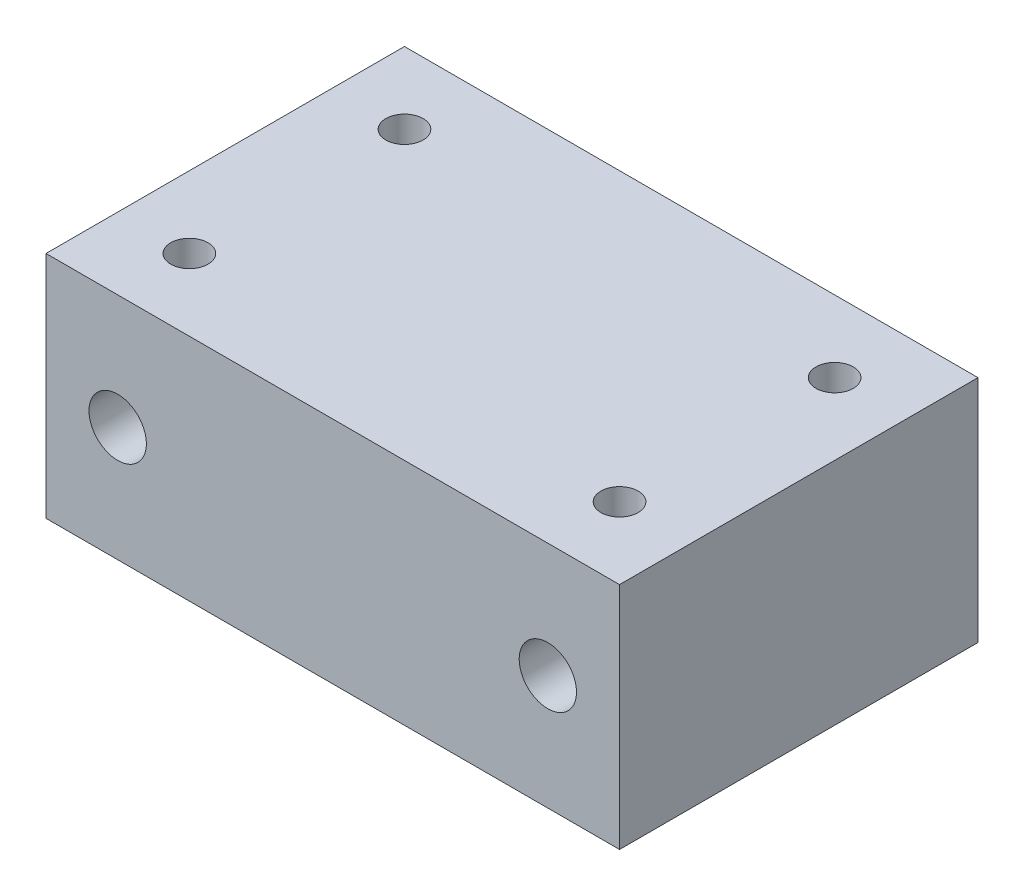
ISO-10303-21;
HEADER;
FILE_DESCRIPTION(('STEP AP214'),'2;1');
FILE_NAME('part.step','',(''),(''),'','','');
FILE_SCHEMA(('AUTOMOTIVE_DESIGN { 1 0 10303 214 1 1 1 1 }'));
ENDSEC;
DATA;
#1=APPLICATION_CONTEXT('core data for automotive mechanical design processes');
#2=APPLICATION_PROTOCOL_DEFINITION('international standard','automotive_design',2000,#1);
#3=PRODUCT_CONTEXT('',#1,'mechanical');
#4=PRODUCT('Part','Part','',(#3));
#5=PRODUCT_RELATED_PRODUCT_CATEGORY('part','',(#4));
#6=PRODUCT_DEFINITION_FORMATION('','',#4);
#7=PRODUCT_DEFINITION_CONTEXT('part definition',#1,'design');
#8=PRODUCT_DEFINITION('design','',#6,#7);
#9=PRODUCT_DEFINITION_SHAPE('','',#8);
#10=(LENGTH_UNIT() NAMED_UNIT(*) SI_UNIT(.MILLI.,.METRE.));
#11=(NAMED_UNIT(*) PLANE_ANGLE_UNIT() SI_UNIT($,.RADIAN.));
#12=(NAMED_UNIT(*) SI_UNIT($,.STERADIAN.) SOLID_ANGLE_UNIT());
#13=UNCERTAINTY_MEASURE_WITH_UNIT(LENGTH_MEASURE(1.E-05),#10,'distance_accuracy_value','');
#14=(GEOMETRIC_REPRESENTATION_CONTEXT(3) GLOBAL_UNCERTAINTY_ASSIGNED_CONTEXT((#13)) GLOBAL_UNIT_ASSIGNED_CONTEXT((#10,
#11,#12)) REPRESENTATION_CONTEXT('',''));
#15=CARTESIAN_POINT('',(0.,0.,0.));
#16=DIRECTION('',(0.,0.,1.));
#17=DIRECTION('',(1.,0.,0.));
#18=AXIS2_PLACEMENT_3D('',#15,#16,#17);
#19=CARTESIAN_POINT('',(40.,32.,-25.));
#20=DIRECTION('',(-1.,0.,0.));
#21=DIRECTION('',(0.,0.,1.));
#22=AXIS2_PLACEMENT_3D('',#19,#20,#21);
#23=PLANE('',#22);
#24=DIRECTION('',(0.,0.,-1.));
#25=VECTOR('',#24,1.);
#26=CARTESIAN_POINT('',(40.,0.,-25.));
#27=LINE('',#26,#25);
#28=CARTESIAN_POINT('',(40.,0.,25.));
#29=VERTEX_POINT('',#28);
#30=CARTESIAN_POINT('',(40.,0.,-25.));
#31=VERTEX_POINT('',#30);
#32=EDGE_CURVE('E98',#29,#31,#27,.T.);
#33=ORIENTED_EDGE('',*,*,#32,.T.);
#34=DIRECTION('',(0.,-1.,0.));
#35=VECTOR('',#34,1.);
#36=CARTESIAN_POINT('',(40.,32.,-25.));
#37=LINE('',#36,#35);
#38=CARTESIAN_POINT('',(40.,32.,-25.));
#39=VERTEX_POINT('',#38);
#40=EDGE_CURVE('E11',#39,#31,#37,.T.);
#41=ORIENTED_EDGE('',*,*,#40,.F.);
#42=DIRECTION('',(0.,0.,-1.));
#43=VECTOR('',#42,1.);
#44=CARTESIAN_POINT('',(40.,32.,-25.));
#45=LINE('',#44,#43);
#46=CARTESIAN_POINT('',(40.,32.,25.));
#47=VERTEX_POINT('',#46);
#48=EDGE_CURVE('E85',#47,#39,#45,.T.);
#49=ORIENTED_EDGE('',*,*,#48,.F.);
#50=DIRECTION('',(0.,-1.,0.));
#51=VECTOR('',#50,1.);
#52=CARTESIAN_POINT('',(40.,32.,25.));
#53=LINE('',#52,#51);
#54=EDGE_CURVE('E94',#47,#29,#53,.T.);
#55=ORIENTED_EDGE('',*,*,#54,.T.);
#56=EDGE_LOOP('',(#33,#41,#49,#55));
#57=FACE_BOUND('',#56,.T.);
#58=ADVANCED_FACE('F32',(#57),#23,.F.);
#59=CARTESIAN_POINT('',(-40.,32.,-25.));
#60=DIRECTION('',(0.,0.,1.));
#61=DIRECTION('',(1.,0.,0.));
#62=AXIS2_PLACEMENT_3D('',#59,#60,#61);
#63=PLANE('',#62);
#64=CARTESIAN_POINT('',(-30.,16.,-25.));
#65=DIRECTION('',(0.,0.,-1.));
#66=DIRECTION('',(-1.,0.,0.));
#67=AXIS2_PLACEMENT_3D('',#64,#65,#66);
#68=CIRCLE('',#67,4.);
#69=CARTESIAN_POINT('',(-34.,16.,-25.));
#70=VERTEX_POINT('',#69);
#71=EDGE_CURVE('E120',#70,#70,#68,.T.);
#72=ORIENTED_EDGE('',*,*,#71,.F.);
#73=EDGE_LOOP('',(#72));
#74=FACE_BOUND('',#73,.T.);
#75=CARTESIAN_POINT('',(30.,16.,-25.));
#76=DIRECTION('',(0.,0.,-1.));
#77=DIRECTION('',(-1.,0.,0.));
#78=AXIS2_PLACEMENT_3D('',#75,#76,#77);
#79=CIRCLE('',#78,4.);
#80=CARTESIAN_POINT('',(26.,16.,-25.));
#81=VERTEX_POINT('',#80);
#82=EDGE_CURVE('E109',#81,#81,#79,.T.);
#83=ORIENTED_EDGE('',*,*,#82,.F.);
#84=EDGE_LOOP('',(#83));
#85=FACE_BOUND('',#84,.T.);
#86=DIRECTION('',(-1.,0.,0.));
#87=VECTOR('',#86,1.);
#88=CARTESIAN_POINT('',(-40.,0.,-25.));
#89=LINE('',#88,#87);
#90=CARTESIAN_POINT('',(-40.,0.,-25.));
#91=VERTEX_POINT('',#90);
#92=EDGE_CURVE('E89',#31,#91,#89,.T.);
#93=ORIENTED_EDGE('',*,*,#92,.T.);
#94=DIRECTION('',(0.,-1.,0.));
#95=VECTOR('',#94,1.);
#96=CARTESIAN_POINT('',(-40.,32.,-25.));
#97=LINE('',#96,#95);
#98=CARTESIAN_POINT('',(-40.,32.,-25.));
#99=VERTEX_POINT('',#98);
#100=EDGE_CURVE('E41',#99,#91,#97,.T.);
#101=ORIENTED_EDGE('',*,*,#100,.F.);
#102=DIRECTION('',(-1.,0.,0.));
#103=VECTOR('',#102,1.);
#104=CARTESIAN_POINT('',(-40.,32.,-25.));
#105=LINE('',#104,#103);
#106=EDGE_CURVE('E80',#39,#99,#105,.T.);
#107=ORIENTED_EDGE('',*,*,#106,.F.);
#108=ORIENTED_EDGE('',*,*,#40,.T.);
#109=EDGE_LOOP('',(#93,#101,#107,#108));
#110=FACE_BOUND('',#109,.T.);
#111=ADVANCED_FACE('F88',(#74,#85,#110),#63,.F.);
#112=CARTESIAN_POINT('',(-40.,32.,-25.));
#113=DIRECTION('',(1.,0.,0.));
#114=DIRECTION('',(0.,0.,-1.));
#115=AXIS2_PLACEMENT_3D('',#112,#113,#114);
#116=PLANE('',#115);
#117=DIRECTION('',(0.,0.,1.));
#118=VECTOR('',#117,1.);
#119=CARTESIAN_POINT('',(-40.,0.,-25.));
#120=LINE('',#119,#118);
#121=CARTESIAN_POINT('',(-40.,0.,25.));
#122=VERTEX_POINT('',#121);
#123=EDGE_CURVE('E67',#91,#122,#120,.T.);
#124=ORIENTED_EDGE('',*,*,#123,.T.);
#125=DIRECTION('',(0.,-1.,0.));
#126=VECTOR('',#125,1.);
#127=CARTESIAN_POINT('',(-40.,32.,25.));
#128=LINE('',#127,#126);
#129=CARTESIAN_POINT('',(-40.,32.,25.));
#130=VERTEX_POINT('',#129);
#131=EDGE_CURVE('E90',#130,#122,#128,.T.);
#132=ORIENTED_EDGE('',*,*,#131,.F.);
#133=DIRECTION('',(0.,0.,1.));
#134=VECTOR('',#133,1.);
#135=CARTESIAN_POINT('',(-40.,32.,-25.));
#136=LINE('',#135,#134);
#137=EDGE_CURVE('E83',#99,#130,#136,.T.);
#138=ORIENTED_EDGE('',*,*,#137,.F.);
#139=ORIENTED_EDGE('',*,*,#100,.T.);
#140=EDGE_LOOP('',(#124,#132,#138,#139));
#141=FACE_BOUND('',#140,.T.);
#142=ADVANCED_FACE('F92',(#141),#116,.F.);
#143=CARTESIAN_POINT('',(-40.,32.,25.));
#144=DIRECTION('',(0.,0.,-1.));
#145=DIRECTION('',(-1.,0.,0.));
#146=AXIS2_PLACEMENT_3D('',#143,#144,#145);
#147=PLANE('',#146);
#148=CARTESIAN_POINT('',(-30.,16.,25.));
#149=DIRECTION('',(0.,0.,-1.));
#150=DIRECTION('',(-1.,0.,0.));
#151=AXIS2_PLACEMENT_3D('',#148,#149,#150);
#152=CIRCLE('',#151,4.);
#153=CARTESIAN_POINT('',(-34.,16.,25.));
#154=VERTEX_POINT('',#153);
#155=EDGE_CURVE('E35',#154,#154,#152,.T.);
#156=ORIENTED_EDGE('',*,*,#155,.T.);
#157=EDGE_LOOP('',(#156));
#158=FACE_BOUND('',#157,.T.);
#159=CARTESIAN_POINT('',(30.,16.,25.));
#160=DIRECTION('',(0.,0.,-1.));
#161=DIRECTION('',(-1.,0.,0.));
#162=AXIS2_PLACEMENT_3D('',#159,#160,#161);
#163=CIRCLE('',#162,4.);
#164=CARTESIAN_POINT('',(26.,16.,25.));
#165=VERTEX_POINT('',#164);
#166=EDGE_CURVE('E106',#165,#165,#163,.T.);
#167=ORIENTED_EDGE('',*,*,#166,.T.);
#168=EDGE_LOOP('',(#167));
#169=FACE_BOUND('',#168,.T.);
#170=DIRECTION('',(1.,0.,0.));
#171=VECTOR('',#170,1.);
#172=CARTESIAN_POINT('',(-40.,0.,25.));
#173=LINE('',#172,#171);
#174=EDGE_CURVE('E73',#122,#29,#173,.T.);
#175=ORIENTED_EDGE('',*,*,#174,.T.);
#176=ORIENTED_EDGE('',*,*,#54,.F.);
#177=DIRECTION('',(1.,0.,0.));
#178=VECTOR('',#177,1.);
#179=CARTESIAN_POINT('',(-40.,32.,25.));
#180=LINE('',#179,#178);
#181=EDGE_CURVE('E50',#130,#47,#180,.T.);
#182=ORIENTED_EDGE('',*,*,#181,.F.);
#183=ORIENTED_EDGE('',*,*,#131,.T.);
#184=EDGE_LOOP('',(#175,#176,#182,#183));
#185=FACE_BOUND('',#184,.T.);
#186=ADVANCED_FACE('F147',(#158,#169,#185),#147,.F.);
#187=CARTESIAN_POINT('',(0.,32.,0.));
#188=DIRECTION('',(0.,1.,0.));
#189=DIRECTION('',(0.,0.,1.));
#190=AXIS2_PLACEMENT_3D('',#187,#188,#189);
#191=PLANE('',#190);
#192=CARTESIAN_POINT('',(30.,32.,-15.));
#193=DIRECTION('',(0.,1.,0.));
#194=DIRECTION('',(0.,0.,-1.));
#195=AXIS2_PLACEMENT_3D('',#192,#193,#194);
#196=CIRCLE('',#195,2.6);
#197=CARTESIAN_POINT('',(30.,32.,-17.6));
#198=VERTEX_POINT('',#197);
#199=EDGE_CURVE('E127',#198,#198,#196,.T.);
#200=ORIENTED_EDGE('',*,*,#199,.F.);
#201=EDGE_LOOP('',(#200));
#202=FACE_BOUND('',#201,.T.);
#203=CARTESIAN_POINT('',(30.,32.,15.));
#204=DIRECTION('',(0.,1.,0.));
#205=DIRECTION('',(0.,0.,1.));
#206=AXIS2_PLACEMENT_3D('',#203,#204,#205);
#207=CIRCLE('',#206,2.6);
#208=CARTESIAN_POINT('',(30.,32.,17.6));
#209=VERTEX_POINT('',#208);
#210=EDGE_CURVE('E133',#209,#209,#207,.T.);
#211=ORIENTED_EDGE('',*,*,#210,.F.);
#212=EDGE_LOOP('',(#211));
#213=FACE_BOUND('',#212,.T.);
#214=CARTESIAN_POINT('',(-30.,32.,15.));
#215=DIRECTION('',(0.,1.,0.));
#216=DIRECTION('',(0.,0.,-1.));
#217=AXIS2_PLACEMENT_3D('',#214,#215,#216);
#218=CIRCLE('',#217,2.6);
#219=CARTESIAN_POINT('',(-30.,32.,12.4));
#220=VERTEX_POINT('',#219);
#221=EDGE_CURVE('E108',#220,#220,#218,.T.);
#222=ORIENTED_EDGE('',*,*,#221,.F.);
#223=EDGE_LOOP('',(#222));
#224=FACE_BOUND('',#223,.T.);
#225=CARTESIAN_POINT('',(-30.,32.,-15.));
#226=DIRECTION('',(0.,1.,0.));
#227=DIRECTION('',(0.,0.,1.));
#228=AXIS2_PLACEMENT_3D('',#225,#226,#227);
#229=CIRCLE('',#228,2.6);
#230=CARTESIAN_POINT('',(-30.,32.,-12.4));
#231=VERTEX_POINT('',#230);
#232=EDGE_CURVE('E126',#231,#231,#229,.T.);
#233=ORIENTED_EDGE('',*,*,#232,.F.);
#234=EDGE_LOOP('',(#233));
#235=FACE_BOUND('',#234,.T.);
#236=ORIENTED_EDGE('',*,*,#48,.T.);
#237=ORIENTED_EDGE('',*,*,#106,.T.);
#238=ORIENTED_EDGE('',*,*,#137,.T.);
#239=ORIENTED_EDGE('',*,*,#181,.T.);
#240=EDGE_LOOP('',(#236,#237,#238,#239));
#241=FACE_BOUND('',#240,.T.);
#242=ADVANCED_FACE('F81',(#202,#213,#224,#235,#241),#191,.T.);
#243=CARTESIAN_POINT('',(0.,0.,0.));
#244=DIRECTION('',(0.,1.,0.));
#245=DIRECTION('',(0.,0.,1.));
#246=AXIS2_PLACEMENT_3D('',#243,#244,#245);
#247=PLANE('',#246);
#248=ORIENTED_EDGE('',*,*,#32,.F.);
#249=ORIENTED_EDGE('',*,*,#174,.F.);
#250=ORIENTED_EDGE('',*,*,#123,.F.);
#251=ORIENTED_EDGE('',*,*,#92,.F.);
#252=EDGE_LOOP('',(#248,#249,#250,#251));
#253=FACE_BOUND('',#252,.T.);
#254=ADVANCED_FACE('F146',(#253),#247,.F.);
#255=CARTESIAN_POINT('',(-30.,27.,-15.));
#256=DIRECTION('',(0.,1.,0.));
#257=DIRECTION('',(0.,0.,1.));
#258=AXIS2_PLACEMENT_3D('',#255,#256,#257);
#259=CYLINDRICAL_SURFACE('',#258,2.6);
#260=CARTESIAN_POINT('',(-30.,27.,-15.));
#261=DIRECTION('',(0.,1.,0.));
#262=DIRECTION('',(0.,0.,1.));
#263=AXIS2_PLACEMENT_3D('',#260,#261,#262);
#264=CIRCLE('',#263,2.6);
#265=CARTESIAN_POINT('',(-30.,27.,-12.4));
#266=VERTEX_POINT('',#265);
#267=EDGE_CURVE('E101',#266,#266,#264,.T.);
#268=ORIENTED_EDGE('',*,*,#267,.F.);
#269=EDGE_LOOP('',(#268));
#270=FACE_BOUND('',#269,.T.);
#271=ORIENTED_EDGE('',*,*,#232,.T.);
#272=EDGE_LOOP('',(#271));
#273=FACE_BOUND('',#272,.T.);
#274=ADVANCED_FACE('F143',(#270,#273),#259,.F.);
#275=CARTESIAN_POINT('',(-30.,27.,-15.));
#276=DIRECTION('',(0.,1.,0.));
#277=DIRECTION('',(0.,0.,1.));
#278=AXIS2_PLACEMENT_3D('',#275,#276,#277);
#279=PLANE('',#278);
#280=ORIENTED_EDGE('',*,*,#267,.T.);
#281=EDGE_LOOP('',(#280));
#282=FACE_BOUND('',#281,.T.);
#283=ADVANCED_FACE('F210',(#282),#279,.T.);
#284=CARTESIAN_POINT('',(-30.,27.,15.));
#285=DIRECTION('',(0.,1.,0.));
#286=DIRECTION('',(0.,0.,1.));
#287=AXIS2_PLACEMENT_3D('',#284,#285,#286);
#288=CYLINDRICAL_SURFACE('',#287,2.6);
#289=CARTESIAN_POINT('',(-30.,27.,15.));
#290=DIRECTION('',(0.,1.,0.));
#291=DIRECTION('',(0.,0.,-1.));
#292=AXIS2_PLACEMENT_3D('',#289,#290,#291);
#293=CIRCLE('',#292,2.6);
#294=CARTESIAN_POINT('',(-30.,27.,12.4));
#295=VERTEX_POINT('',#294);
#296=EDGE_CURVE('E113',#295,#295,#293,.T.);
#297=ORIENTED_EDGE('',*,*,#296,.F.);
#298=EDGE_LOOP('',(#297));
#299=FACE_BOUND('',#298,.T.);
#300=ORIENTED_EDGE('',*,*,#221,.T.);
#301=EDGE_LOOP('',(#300));
#302=FACE_BOUND('',#301,.T.);
#303=ADVANCED_FACE('F206',(#299,#302),#288,.F.);
#304=CARTESIAN_POINT('',(-30.,27.,15.));
#305=DIRECTION('',(0.,-1.,0.));
#306=DIRECTION('',(0.,0.,-1.));
#307=AXIS2_PLACEMENT_3D('',#304,#305,#306);
#308=PLANE('',#307);
#309=ORIENTED_EDGE('',*,*,#296,.T.);
#310=EDGE_LOOP('',(#309));
#311=FACE_BOUND('',#310,.T.);
#312=ADVANCED_FACE('F202',(#311),#308,.F.);
#313=CARTESIAN_POINT('',(30.,27.,15.));
#314=DIRECTION('',(0.,1.,0.));
#315=DIRECTION('',(0.,0.,1.));
#316=AXIS2_PLACEMENT_3D('',#313,#314,#315);
#317=CYLINDRICAL_SURFACE('',#316,2.6);
#318=CARTESIAN_POINT('',(30.,27.,15.));
#319=DIRECTION('',(0.,1.,0.));
#320=DIRECTION('',(0.,0.,1.));
#321=AXIS2_PLACEMENT_3D('',#318,#319,#320);
#322=CIRCLE('',#321,2.6);
#323=CARTESIAN_POINT('',(30.,27.,17.6));
#324=VERTEX_POINT('',#323);
#325=EDGE_CURVE('E130',#324,#324,#322,.T.);
#326=ORIENTED_EDGE('',*,*,#325,.F.);
#327=EDGE_LOOP('',(#326));
#328=FACE_BOUND('',#327,.T.);
#329=ORIENTED_EDGE('',*,*,#210,.T.);
#330=EDGE_LOOP('',(#329));
#331=FACE_BOUND('',#330,.T.);
#332=ADVANCED_FACE('F198',(#328,#331),#317,.F.);
#333=CARTESIAN_POINT('',(30.,27.,15.));
#334=DIRECTION('',(0.,1.,0.));
#335=DIRECTION('',(0.,0.,1.));
#336=AXIS2_PLACEMENT_3D('',#333,#334,#335);
#337=PLANE('',#336);
#338=ORIENTED_EDGE('',*,*,#325,.T.);
#339=EDGE_LOOP('',(#338));
#340=FACE_BOUND('',#339,.T.);
#341=ADVANCED_FACE('F194',(#340),#337,.T.);
#342=CARTESIAN_POINT('',(30.,27.,-15.));
#343=DIRECTION('',(0.,1.,0.));
#344=DIRECTION('',(0.,0.,1.));
#345=AXIS2_PLACEMENT_3D('',#342,#343,#344);
#346=CYLINDRICAL_SURFACE('',#345,2.6);
#347=CARTESIAN_POINT('',(30.,27.,-15.));
#348=DIRECTION('',(0.,1.,0.));
#349=DIRECTION('',(0.,0.,-1.));
#350=AXIS2_PLACEMENT_3D('',#347,#348,#349);
#351=CIRCLE('',#350,2.6);
#352=CARTESIAN_POINT('',(30.,27.,-17.6));
#353=VERTEX_POINT('',#352);
#354=EDGE_CURVE('E123',#353,#353,#351,.T.);
#355=ORIENTED_EDGE('',*,*,#354,.F.);
#356=EDGE_LOOP('',(#355));
#357=FACE_BOUND('',#356,.T.);
#358=ORIENTED_EDGE('',*,*,#199,.T.);
#359=EDGE_LOOP('',(#358));
#360=FACE_BOUND('',#359,.T.);
#361=ADVANCED_FACE('F190',(#357,#360),#346,.F.);
#362=CARTESIAN_POINT('',(30.,27.,-15.));
#363=DIRECTION('',(0.,-1.,0.));
#364=DIRECTION('',(0.,0.,-1.));
#365=AXIS2_PLACEMENT_3D('',#362,#363,#364);
#366=PLANE('',#365);
#367=ORIENTED_EDGE('',*,*,#354,.T.);
#368=EDGE_LOOP('',(#367));
#369=FACE_BOUND('',#368,.T.);
#370=ADVANCED_FACE('F185',(#369),#366,.F.);
#371=CARTESIAN_POINT('',(30.,16.,40.));
#372=DIRECTION('',(0.,0.,-1.));
#373=DIRECTION('',(-1.,0.,0.));
#374=AXIS2_PLACEMENT_3D('',#371,#372,#373);
#375=CYLINDRICAL_SURFACE('',#374,4.);
#376=ORIENTED_EDGE('',*,*,#82,.T.);
#377=EDGE_LOOP('',(#376));
#378=FACE_BOUND('',#377,.T.);
#379=ORIENTED_EDGE('',*,*,#166,.F.);
#380=EDGE_LOOP('',(#379));
#381=FACE_BOUND('',#380,.T.);
#382=ADVANCED_FACE('F179',(#378,#381),#375,.F.);
#383=CARTESIAN_POINT('',(-30.,16.,40.));
#384=DIRECTION('',(0.,0.,-1.));
#385=DIRECTION('',(-1.,0.,0.));
#386=AXIS2_PLACEMENT_3D('',#383,#384,#385);
#387=CYLINDRICAL_SURFACE('',#386,4.);
#388=ORIENTED_EDGE('',*,*,#71,.T.);
#389=EDGE_LOOP('',(#388));
#390=FACE_BOUND('',#389,.T.);
#391=ORIENTED_EDGE('',*,*,#155,.F.);
#392=EDGE_LOOP('',(#391));
#393=FACE_BOUND('',#392,.T.);
#394=ADVANCED_FACE('F176',(#390,#393),#387,.F.);
#395=CLOSED_SHELL('',(#58,#111,#142,#186,#242,#254,#274,#283,#303,#312,#332,#341,#361,#370,#382,#394));
#396=MANIFOLD_SOLID_BREP('B2',#395);
#397=ADVANCED_BREP_SHAPE_REPRESENTATION('',(#18,#396),#14);
#398=SHAPE_DEFINITION_REPRESENTATION(#9,#397);
ENDSEC;
END-ISO-10303-21;
